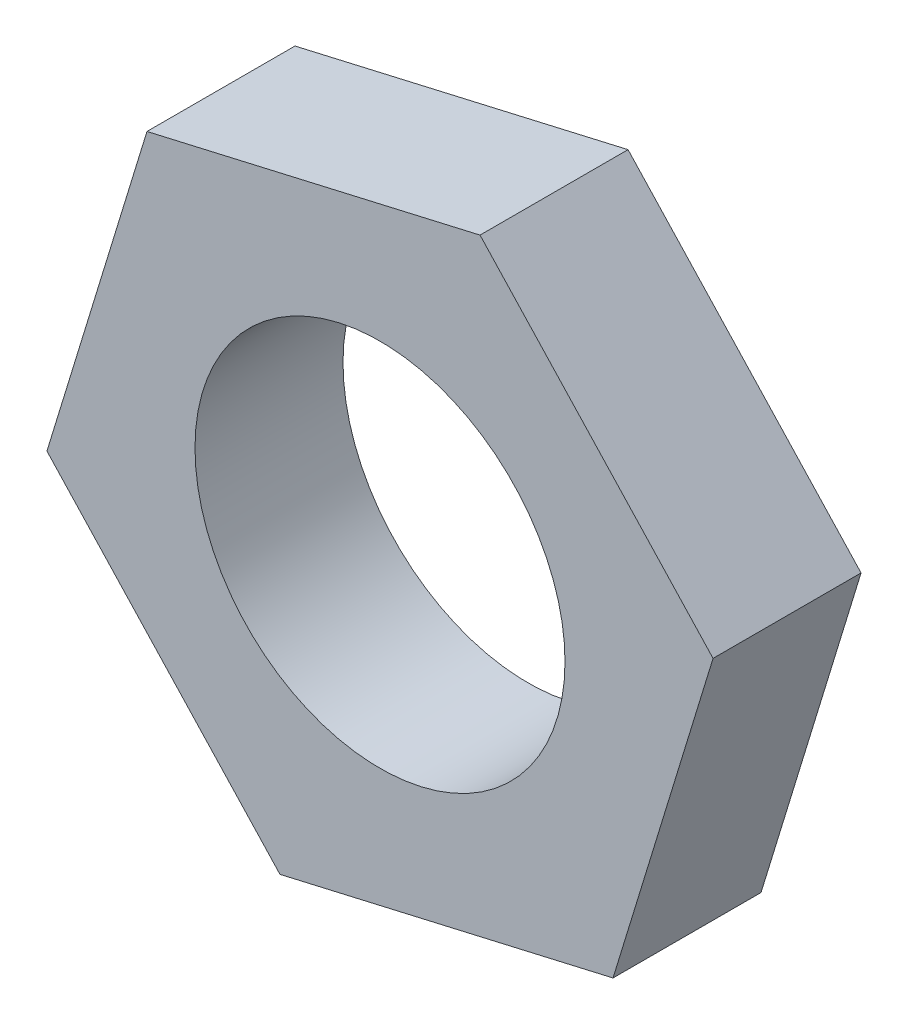
ISO-10303-21;
HEADER;
FILE_DESCRIPTION(('STEP AP214'),'2;1');
FILE_NAME('part.step','',(''),(''),'','','');
FILE_SCHEMA(('AUTOMOTIVE_DESIGN { 1 0 10303 214 1 1 1 1 }'));
ENDSEC;
DATA;
#1=APPLICATION_CONTEXT('core data for automotive mechanical design processes');
#2=APPLICATION_PROTOCOL_DEFINITION('international standard','automotive_design',2000,#1);
#3=PRODUCT_CONTEXT('',#1,'mechanical');
#4=PRODUCT('Part','Part','',(#3));
#5=PRODUCT_RELATED_PRODUCT_CATEGORY('part','',(#4));
#6=PRODUCT_DEFINITION_FORMATION('','',#4);
#7=PRODUCT_DEFINITION_CONTEXT('part definition',#1,'design');
#8=PRODUCT_DEFINITION('design','',#6,#7);
#9=PRODUCT_DEFINITION_SHAPE('','',#8);
#10=(LENGTH_UNIT() NAMED_UNIT(*) SI_UNIT(.MILLI.,.METRE.));
#11=(NAMED_UNIT(*) PLANE_ANGLE_UNIT() SI_UNIT($,.RADIAN.));
#12=(NAMED_UNIT(*) SI_UNIT($,.STERADIAN.) SOLID_ANGLE_UNIT());
#13=UNCERTAINTY_MEASURE_WITH_UNIT(LENGTH_MEASURE(1.E-05),#10,'distance_accuracy_value','');
#14=(GEOMETRIC_REPRESENTATION_CONTEXT(3) GLOBAL_UNCERTAINTY_ASSIGNED_CONTEXT((#13)) GLOBAL_UNIT_ASSIGNED_CONTEXT((#10,
#11,#12)) REPRESENTATION_CONTEXT('',''));
#15=CARTESIAN_POINT('',(0.,0.,0.));
#16=DIRECTION('',(0.,0.,1.));
#17=DIRECTION('',(1.,0.,0.));
#18=AXIS2_PLACEMENT_3D('',#15,#16,#17);
#19=CARTESIAN_POINT('',(13.5187927031895,44.1653209790388,20.));
#20=DIRECTION('',(0.224626260991964,-0.9744449922252,0.));
#21=DIRECTION('',(0.9744449922252,0.224626260991964,0.));
#22=AXIS2_PLACEMENT_3D('',#19,#20,#21);
#23=PLANE('',#22);
#24=DIRECTION('',(-0.9744449922252,-0.224626260991964,0.));
#25=VECTOR('',#24,1.);
#26=CARTESIAN_POINT('',(13.5187927031895,44.1653209790388,0.));
#27=LINE('',#26,#25);
#28=CARTESIAN_POINT('',(13.5187927031895,44.1653209790388,0.));
#29=VERTEX_POINT('',#28);
#30=CARTESIAN_POINT('',(-31.4888935825467,33.7902783989772,0.));
#31=VERTEX_POINT('',#30);
#32=EDGE_CURVE('E117',#29,#31,#27,.T.);
#33=ORIENTED_EDGE('',*,*,#32,.T.);
#34=DIRECTION('',(0.,0.,-1.));
#35=VECTOR('',#34,1.);
#36=CARTESIAN_POINT('',(-31.4888935825467,33.7902783989772,20.));
#37=LINE('',#36,#35);
#38=CARTESIAN_POINT('',(-31.4888935825467,33.7902783989772,20.));
#39=VERTEX_POINT('',#38);
#40=EDGE_CURVE('E11',#39,#31,#37,.T.);
#41=ORIENTED_EDGE('',*,*,#40,.F.);
#42=DIRECTION('',(-0.9744449922252,-0.224626260991964,0.));
#43=VECTOR('',#42,1.);
#44=CARTESIAN_POINT('',(13.5187927031895,44.1653209790388,20.));
#45=LINE('',#44,#43);
#46=CARTESIAN_POINT('',(13.5187927031895,44.1653209790388,20.));
#47=VERTEX_POINT('',#46);
#48=EDGE_CURVE('E128',#47,#39,#45,.T.);
#49=ORIENTED_EDGE('',*,*,#48,.F.);
#50=DIRECTION('',(0.,0.,-1.));
#51=VECTOR('',#50,1.);
#52=CARTESIAN_POINT('',(13.5187927031895,44.1653209790388,20.));
#53=LINE('',#52,#51);
#54=EDGE_CURVE('E113',#47,#29,#53,.T.);
#55=ORIENTED_EDGE('',*,*,#54,.T.);
#56=EDGE_LOOP('',(#33,#41,#49,#55));
#57=FACE_BOUND('',#56,.T.);
#58=ADVANCED_FACE('F33',(#57),#23,.F.);
#59=CARTESIAN_POINT('',(-31.4888935825467,33.7902783989772,20.));
#60=DIRECTION('',(0.956207248353535,-0.292690447736445,0.));
#61=DIRECTION('',(0.292690447736445,0.956207248353535,0.));
#62=AXIS2_PLACEMENT_3D('',#59,#60,#61);
#63=PLANE('',#62);
#64=DIRECTION('',(-0.292690447736445,-0.956207248353535,0.));
#65=VECTOR('',#64,1.);
#66=CARTESIAN_POINT('',(-31.4888935825467,33.7902783989772,0.));
#67=LINE('',#66,#65);
#68=CARTESIAN_POINT('',(-45.0076862857361,-10.3750425800616,0.));
#69=VERTEX_POINT('',#68);
#70=EDGE_CURVE('E120',#31,#69,#67,.T.);
#71=ORIENTED_EDGE('',*,*,#70,.T.);
#72=DIRECTION('',(0.,0.,-1.));
#73=VECTOR('',#72,1.);
#74=CARTESIAN_POINT('',(-45.0076862857361,-10.3750425800616,20.));
#75=LINE('',#74,#73);
#76=CARTESIAN_POINT('',(-45.0076862857361,-10.3750425800616,20.));
#77=VERTEX_POINT('',#76);
#78=EDGE_CURVE('E41',#77,#69,#75,.T.);
#79=ORIENTED_EDGE('',*,*,#78,.F.);
#80=DIRECTION('',(-0.292690447736445,-0.956207248353535,0.));
#81=VECTOR('',#80,1.);
#82=CARTESIAN_POINT('',(-31.4888935825467,33.7902783989772,20.));
#83=LINE('',#82,#81);
#84=EDGE_CURVE('E86',#39,#77,#83,.T.);
#85=ORIENTED_EDGE('',*,*,#84,.F.);
#86=ORIENTED_EDGE('',*,*,#40,.T.);
#87=EDGE_LOOP('',(#71,#79,#85,#86));
#88=FACE_BOUND('',#87,.T.);
#89=ADVANCED_FACE('F153',(#88),#63,.F.);
#90=CARTESIAN_POINT('',(-45.0076862857361,-10.3750425800616,20.));
#91=DIRECTION('',(0.731580987361571,0.681754544488755,0.));
#92=DIRECTION('',(-0.681754544488755,0.731580987361571,0.));
#93=AXIS2_PLACEMENT_3D('',#90,#91,#92);
#94=PLANE('',#93);
#95=DIRECTION('',(0.681754544488755,-0.731580987361571,0.));
#96=VECTOR('',#95,1.);
#97=CARTESIAN_POINT('',(-45.0076862857361,-10.3750425800616,0.));
#98=LINE('',#97,#96);
#99=CARTESIAN_POINT('',(-13.5187927031895,-44.1653209790388,0.));
#100=VERTEX_POINT('',#99);
#101=EDGE_CURVE('E123',#69,#100,#98,.T.);
#102=ORIENTED_EDGE('',*,*,#101,.T.);
#103=DIRECTION('',(0.,0.,-1.));
#104=VECTOR('',#103,1.);
#105=CARTESIAN_POINT('',(-13.5187927031895,-44.1653209790388,20.));
#106=LINE('',#105,#104);
#107=CARTESIAN_POINT('',(-13.5187927031895,-44.1653209790388,20.));
#108=VERTEX_POINT('',#107);
#109=EDGE_CURVE('E108',#108,#100,#106,.T.);
#110=ORIENTED_EDGE('',*,*,#109,.F.);
#111=DIRECTION('',(0.681754544488755,-0.731580987361571,0.));
#112=VECTOR('',#111,1.);
#113=CARTESIAN_POINT('',(-45.0076862857361,-10.3750425800616,20.));
#114=LINE('',#113,#112);
#115=EDGE_CURVE('E99',#77,#108,#114,.T.);
#116=ORIENTED_EDGE('',*,*,#115,.F.);
#117=ORIENTED_EDGE('',*,*,#78,.T.);
#118=EDGE_LOOP('',(#102,#110,#116,#117));
#119=FACE_BOUND('',#118,.T.);
#120=ADVANCED_FACE('F134',(#119),#94,.F.);
#121=CARTESIAN_POINT('',(-13.5187927031895,-44.1653209790388,20.));
#122=DIRECTION('',(-0.224626260991964,0.9744449922252,0.));
#123=DIRECTION('',(-0.9744449922252,-0.224626260991964,0.));
#124=AXIS2_PLACEMENT_3D('',#121,#122,#123);
#125=PLANE('',#124);
#126=DIRECTION('',(0.9744449922252,0.224626260991964,0.));
#127=VECTOR('',#126,1.);
#128=CARTESIAN_POINT('',(-13.5187927031895,-44.1653209790388,0.));
#129=LINE('',#128,#127);
#130=CARTESIAN_POINT('',(31.4888935825467,-33.7902783989772,0.));
#131=VERTEX_POINT('',#130);
#132=EDGE_CURVE('E107',#100,#131,#129,.T.);
#133=ORIENTED_EDGE('',*,*,#132,.T.);
#134=DIRECTION('',(0.,0.,-1.));
#135=VECTOR('',#134,1.);
#136=CARTESIAN_POINT('',(31.4888935825467,-33.7902783989772,20.));
#137=LINE('',#136,#135);
#138=CARTESIAN_POINT('',(31.4888935825467,-33.7902783989772,20.));
#139=VERTEX_POINT('',#138);
#140=EDGE_CURVE('E104',#139,#131,#137,.T.);
#141=ORIENTED_EDGE('',*,*,#140,.F.);
#142=DIRECTION('',(0.9744449922252,0.224626260991964,0.));
#143=VECTOR('',#142,1.);
#144=CARTESIAN_POINT('',(-13.5187927031895,-44.1653209790388,20.));
#145=LINE('',#144,#143);
#146=EDGE_CURVE('E93',#108,#139,#145,.T.);
#147=ORIENTED_EDGE('',*,*,#146,.F.);
#148=ORIENTED_EDGE('',*,*,#109,.T.);
#149=EDGE_LOOP('',(#133,#141,#147,#148));
#150=FACE_BOUND('',#149,.T.);
#151=ADVANCED_FACE('F105',(#150),#125,.F.);
#152=CARTESIAN_POINT('',(31.4888935825467,-33.7902783989772,20.));
#153=DIRECTION('',(-0.956207248353535,0.292690447736445,0.));
#154=DIRECTION('',(-0.292690447736445,-0.956207248353535,0.));
#155=AXIS2_PLACEMENT_3D('',#152,#153,#154);
#156=PLANE('',#155);
#157=DIRECTION('',(0.292690447736445,0.956207248353535,0.));
#158=VECTOR('',#157,1.);
#159=CARTESIAN_POINT('',(31.4888935825467,-33.7902783989772,0.));
#160=LINE('',#159,#158);
#161=CARTESIAN_POINT('',(45.0076862857361,10.3750425800616,0.));
#162=VERTEX_POINT('',#161);
#163=EDGE_CURVE('E72',#131,#162,#160,.T.);
#164=ORIENTED_EDGE('',*,*,#163,.T.);
#165=DIRECTION('',(0.,0.,-1.));
#166=VECTOR('',#165,1.);
#167=CARTESIAN_POINT('',(45.0076862857361,10.3750425800616,20.));
#168=LINE('',#167,#166);
#169=CARTESIAN_POINT('',(45.0076862857361,10.3750425800616,20.));
#170=VERTEX_POINT('',#169);
#171=EDGE_CURVE('E109',#170,#162,#168,.T.);
#172=ORIENTED_EDGE('',*,*,#171,.F.);
#173=DIRECTION('',(0.292690447736445,0.956207248353535,0.));
#174=VECTOR('',#173,1.);
#175=CARTESIAN_POINT('',(31.4888935825467,-33.7902783989772,20.));
#176=LINE('',#175,#174);
#177=EDGE_CURVE('E97',#139,#170,#176,.T.);
#178=ORIENTED_EDGE('',*,*,#177,.F.);
#179=ORIENTED_EDGE('',*,*,#140,.T.);
#180=EDGE_LOOP('',(#164,#172,#178,#179));
#181=FACE_BOUND('',#180,.T.);
#182=ADVANCED_FACE('F111',(#181),#156,.F.);
#183=CARTESIAN_POINT('',(45.0076862857361,10.3750425800616,20.));
#184=DIRECTION('',(-0.731580987361571,-0.681754544488755,0.));
#185=DIRECTION('',(0.681754544488755,-0.731580987361571,0.));
#186=AXIS2_PLACEMENT_3D('',#183,#184,#185);
#187=PLANE('',#186);
#188=DIRECTION('',(-0.681754544488755,0.731580987361571,0.));
#189=VECTOR('',#188,1.);
#190=CARTESIAN_POINT('',(45.0076862857361,10.3750425800616,0.));
#191=LINE('',#190,#189);
#192=EDGE_CURVE('E78',#162,#29,#191,.T.);
#193=ORIENTED_EDGE('',*,*,#192,.T.);
#194=ORIENTED_EDGE('',*,*,#54,.F.);
#195=DIRECTION('',(-0.681754544488755,0.731580987361571,0.));
#196=VECTOR('',#195,1.);
#197=CARTESIAN_POINT('',(45.0076862857361,10.3750425800616,20.));
#198=LINE('',#197,#196);
#199=EDGE_CURVE('E49',#170,#47,#198,.T.);
#200=ORIENTED_EDGE('',*,*,#199,.F.);
#201=ORIENTED_EDGE('',*,*,#171,.T.);
#202=EDGE_LOOP('',(#193,#194,#200,#201));
#203=FACE_BOUND('',#202,.T.);
#204=ADVANCED_FACE('F141',(#203),#187,.F.);
#205=CARTESIAN_POINT('',(0.,0.,20.));
#206=DIRECTION('',(0.,0.,1.));
#207=DIRECTION('',(1.,0.,0.));
#208=AXIS2_PLACEMENT_3D('',#205,#206,#207);
#209=PLANE('',#208);
#210=CARTESIAN_POINT('',(0.,0.,20.));
#211=DIRECTION('',(0.,0.,1.));
#212=DIRECTION('',(1.,0.,0.));
#213=AXIS2_PLACEMENT_3D('',#210,#211,#212);
#214=CIRCLE('',#213,25.);
#215=CARTESIAN_POINT('',(25.,0.,20.));
#216=VERTEX_POINT('',#215);
#217=EDGE_CURVE('E208',#216,#216,#214,.T.);
#218=ORIENTED_EDGE('',*,*,#217,.F.);
#219=EDGE_LOOP('',(#218));
#220=FACE_BOUND('',#219,.T.);
#221=ORIENTED_EDGE('',*,*,#48,.T.);
#222=ORIENTED_EDGE('',*,*,#84,.T.);
#223=ORIENTED_EDGE('',*,*,#115,.T.);
#224=ORIENTED_EDGE('',*,*,#146,.T.);
#225=ORIENTED_EDGE('',*,*,#177,.T.);
#226=ORIENTED_EDGE('',*,*,#199,.T.);
#227=EDGE_LOOP('',(#221,#222,#223,#224,#225,#226));
#228=FACE_BOUND('',#227,.T.);
#229=ADVANCED_FACE('F95',(#220,#228),#209,.T.);
#230=CARTESIAN_POINT('',(0.,0.,0.));
#231=DIRECTION('',(0.,0.,1.));
#232=DIRECTION('',(1.,0.,0.));
#233=AXIS2_PLACEMENT_3D('',#230,#231,#232);
#234=PLANE('',#233);
#235=CARTESIAN_POINT('',(0.,0.,0.));
#236=DIRECTION('',(0.,0.,1.));
#237=DIRECTION('',(1.,0.,0.));
#238=AXIS2_PLACEMENT_3D('',#235,#236,#237);
#239=CIRCLE('',#238,25.);
#240=CARTESIAN_POINT('',(25.,0.,0.));
#241=VERTEX_POINT('',#240);
#242=EDGE_CURVE('E121',#241,#241,#239,.T.);
#243=ORIENTED_EDGE('',*,*,#242,.T.);
#244=EDGE_LOOP('',(#243));
#245=FACE_BOUND('',#244,.T.);
#246=ORIENTED_EDGE('',*,*,#32,.F.);
#247=ORIENTED_EDGE('',*,*,#192,.F.);
#248=ORIENTED_EDGE('',*,*,#163,.F.);
#249=ORIENTED_EDGE('',*,*,#132,.F.);
#250=ORIENTED_EDGE('',*,*,#101,.F.);
#251=ORIENTED_EDGE('',*,*,#70,.F.);
#252=EDGE_LOOP('',(#246,#247,#248,#249,#250,#251));
#253=FACE_BOUND('',#252,.T.);
#254=ADVANCED_FACE('F137',(#245,#253),#234,.F.);
#255=CARTESIAN_POINT('',(0.,0.,0.));
#256=DIRECTION('',(0.,0.,1.));
#257=DIRECTION('',(1.,0.,0.));
#258=AXIS2_PLACEMENT_3D('',#255,#256,#257);
#259=CYLINDRICAL_SURFACE('',#258,25.);
#260=ORIENTED_EDGE('',*,*,#242,.F.);
#261=EDGE_LOOP('',(#260));
#262=FACE_BOUND('',#261,.T.);
#263=ORIENTED_EDGE('',*,*,#217,.T.);
#264=EDGE_LOOP('',(#263));
#265=FACE_BOUND('',#264,.T.);
#266=ADVANCED_FACE('F190',(#262,#265),#259,.F.);
#267=CLOSED_SHELL('',(#58,#89,#120,#151,#182,#204,#229,#254,#266));
#268=MANIFOLD_SOLID_BREP('B2',#267);
#269=ADVANCED_BREP_SHAPE_REPRESENTATION('',(#18,#268),#14);
#270=SHAPE_DEFINITION_REPRESENTATION(#9,#269);
ENDSEC;
END-ISO-10303-21;
